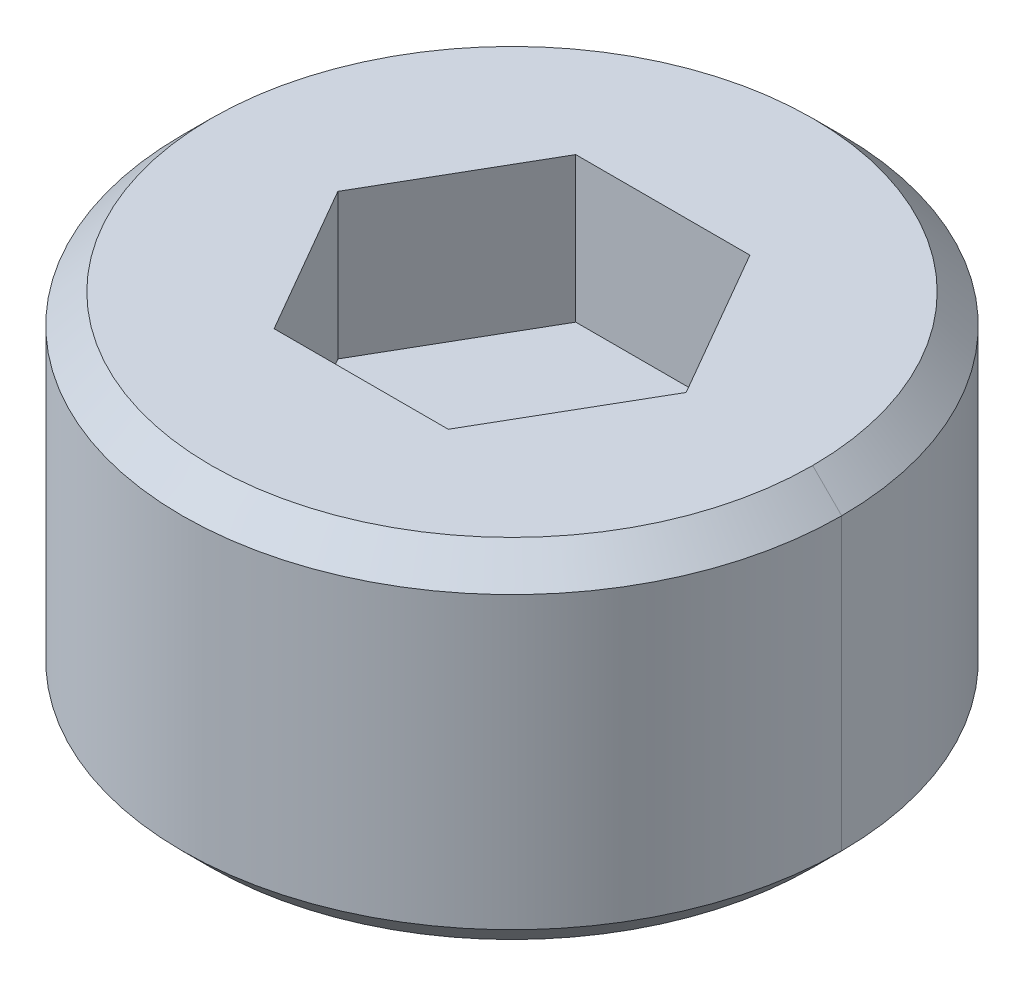
ISO-10303-21;
HEADER;
FILE_DESCRIPTION(('STEP AP214'),'2;1');
FILE_NAME('part.step','',(''),(''),'','','');
FILE_SCHEMA(('AUTOMOTIVE_DESIGN { 1 0 10303 214 1 1 1 1 }'));
ENDSEC;
DATA;
#1=APPLICATION_CONTEXT('core data for automotive mechanical design processes');
#2=APPLICATION_PROTOCOL_DEFINITION('international standard','automotive_design',2000,#1);
#3=PRODUCT_CONTEXT('',#1,'mechanical');
#4=PRODUCT('Part','Part','',(#3));
#5=PRODUCT_RELATED_PRODUCT_CATEGORY('part','',(#4));
#6=PRODUCT_DEFINITION_FORMATION('','',#4);
#7=PRODUCT_DEFINITION_CONTEXT('part definition',#1,'design');
#8=PRODUCT_DEFINITION('design','',#6,#7);
#9=PRODUCT_DEFINITION_SHAPE('','',#8);
#10=(LENGTH_UNIT() NAMED_UNIT(*) SI_UNIT(.MILLI.,.METRE.));
#11=(NAMED_UNIT(*) PLANE_ANGLE_UNIT() SI_UNIT($,.RADIAN.));
#12=(NAMED_UNIT(*) SI_UNIT($,.STERADIAN.) SOLID_ANGLE_UNIT());
#13=UNCERTAINTY_MEASURE_WITH_UNIT(LENGTH_MEASURE(1.E-05),#10,'distance_accuracy_value','');
#14=(GEOMETRIC_REPRESENTATION_CONTEXT(3) GLOBAL_UNCERTAINTY_ASSIGNED_CONTEXT((#13)) GLOBAL_UNIT_ASSIGNED_CONTEXT((#10,
#11,#12)) REPRESENTATION_CONTEXT('',''));
#15=CARTESIAN_POINT('',(0.,0.,0.));
#16=DIRECTION('',(0.,0.,1.));
#17=DIRECTION('',(1.,0.,0.));
#18=AXIS2_PLACEMENT_3D('',#15,#16,#17);
#19=CARTESIAN_POINT('',(0.,1.75,0.));
#20=DIRECTION('',(0.,1.,0.));
#21=DIRECTION('',(1.,0.,0.));
#22=AXIS2_PLACEMENT_3D('',#19,#20,#21);
#23=PLANE('',#22);
#24=DIRECTION('',(1.,0.,0.));
#25=VECTOR('',#24,1.);
#26=CARTESIAN_POINT('',(-0.7499999999999,1.75,1.299038105677));
#27=LINE('',#26,#25);
#28=CARTESIAN_POINT('',(-0.7499999999999,1.75,1.299038105677));
#29=VERTEX_POINT('',#28);
#30=CARTESIAN_POINT('',(0.75,1.75,1.299038105677));
#31=VERTEX_POINT('',#30);
#32=EDGE_CURVE('E11',#29,#31,#27,.T.);
#33=ORIENTED_EDGE('',*,*,#32,.T.);
#34=DIRECTION('',(-0.499999999999974,0.,0.866025403784454));
#35=VECTOR('',#34,1.);
#36=CARTESIAN_POINT('',(1.5,1.75,0.));
#37=LINE('',#36,#35);
#38=CARTESIAN_POINT('',(1.5,1.75,0.));
#39=VERTEX_POINT('',#38);
#40=EDGE_CURVE('E266',#39,#31,#37,.T.);
#41=ORIENTED_EDGE('',*,*,#40,.F.);
#42=DIRECTION('',(0.500000000000017,0.,0.866025403784429));
#43=VECTOR('',#42,1.);
#44=CARTESIAN_POINT('',(0.7499999999999,1.75,-1.299038105677));
#45=LINE('',#44,#43);
#46=CARTESIAN_POINT('',(0.7499999999999,1.75,-1.299038105677));
#47=VERTEX_POINT('',#46);
#48=EDGE_CURVE('E245',#47,#39,#45,.T.);
#49=ORIENTED_EDGE('',*,*,#48,.F.);
#50=DIRECTION('',(-1.,0.,0.));
#51=VECTOR('',#50,1.);
#52=CARTESIAN_POINT('',(0.7499999999999,1.75,-1.299038105677));
#53=LINE('',#52,#51);
#54=CARTESIAN_POINT('',(-0.75,1.75,-1.299038105677));
#55=VERTEX_POINT('',#54);
#56=EDGE_CURVE('E202',#47,#55,#53,.T.);
#57=ORIENTED_EDGE('',*,*,#56,.T.);
#58=DIRECTION('',(0.499999999999974,0.,-0.866025403784454));
#59=VECTOR('',#58,1.);
#60=CARTESIAN_POINT('',(-1.5,1.75,0.));
#61=LINE('',#60,#59);
#62=CARTESIAN_POINT('',(-1.5,1.75,0.));
#63=VERTEX_POINT('',#62);
#64=EDGE_CURVE('E164',#63,#55,#61,.T.);
#65=ORIENTED_EDGE('',*,*,#64,.F.);
#66=DIRECTION('',(-0.500000000000017,0.,-0.866025403784429));
#67=VECTOR('',#66,1.);
#68=CARTESIAN_POINT('',(-0.7499999999999,1.75,1.299038105677));
#69=LINE('',#68,#67);
#70=EDGE_CURVE('E159',#29,#63,#69,.T.);
#71=ORIENTED_EDGE('',*,*,#70,.F.);
#72=EDGE_LOOP('',(#33,#41,#49,#57,#65,#71));
#73=FACE_BOUND('',#72,.T.);
#74=ADVANCED_FACE('F17',(#73),#23,.T.);
#75=CARTESIAN_POINT('',(-0.75,3.,1.299038105677));
#76=DIRECTION('',(0.,0.,1.));
#77=DIRECTION('',(1.,0.,0.));
#78=AXIS2_PLACEMENT_3D('',#75,#76,#77);
#79=PLANE('',#78);
#80=DIRECTION('',(0.,-1.,0.));
#81=VECTOR('',#80,1.);
#82=CARTESIAN_POINT('',(0.75,3.,1.299038105677));
#83=LINE('',#82,#81);
#84=CARTESIAN_POINT('',(0.75,3.,1.299038105677));
#85=VERTEX_POINT('',#84);
#86=EDGE_CURVE('E28',#85,#31,#83,.T.);
#87=ORIENTED_EDGE('',*,*,#86,.T.);
#88=ORIENTED_EDGE('',*,*,#32,.F.);
#89=DIRECTION('',(0.,-1.,0.));
#90=VECTOR('',#89,1.);
#91=CARTESIAN_POINT('',(-0.7499999999998,3.,1.299038105677));
#92=LINE('',#91,#90);
#93=CARTESIAN_POINT('',(-0.7499999999998,3.,1.299038105677));
#94=VERTEX_POINT('',#93);
#95=EDGE_CURVE('E195',#94,#29,#92,.T.);
#96=ORIENTED_EDGE('',*,*,#95,.F.);
#97=DIRECTION('',(1.,0.,0.));
#98=VECTOR('',#97,1.);
#99=CARTESIAN_POINT('',(-0.7499999999998,3.,1.299038105677));
#100=LINE('',#99,#98);
#101=EDGE_CURVE('E173',#94,#85,#100,.T.);
#102=ORIENTED_EDGE('',*,*,#101,.T.);
#103=EDGE_LOOP('',(#87,#88,#96,#102));
#104=FACE_BOUND('',#103,.T.);
#105=ADVANCED_FACE('F322',(#104),#79,.F.);
#106=CARTESIAN_POINT('',(0.75,3.,1.299038105677));
#107=DIRECTION('',(0.866025403784429,0.,0.500000000000017));
#108=DIRECTION('',(0.,-1.,0.));
#109=AXIS2_PLACEMENT_3D('',#106,#107,#108);
#110=PLANE('',#109);
#111=DIRECTION('',(0.,-1.,0.));
#112=VECTOR('',#111,1.);
#113=CARTESIAN_POINT('',(1.5,3.,1.416526265779E-13));
#114=LINE('',#113,#112);
#115=CARTESIAN_POINT('',(1.5,3.,1.416644579422E-13));
#116=VERTEX_POINT('',#115);
#117=EDGE_CURVE('E248',#116,#39,#114,.T.);
#118=ORIENTED_EDGE('',*,*,#117,.T.);
#119=ORIENTED_EDGE('',*,*,#40,.T.);
#120=ORIENTED_EDGE('',*,*,#86,.F.);
#121=DIRECTION('',(0.499999999999974,0.,-0.866025403784454));
#122=VECTOR('',#121,1.);
#123=CARTESIAN_POINT('',(0.75,3.,1.299038105677));
#124=LINE('',#123,#122);
#125=EDGE_CURVE('E208',#85,#116,#124,.T.);
#126=ORIENTED_EDGE('',*,*,#125,.T.);
#127=EDGE_LOOP('',(#118,#119,#120,#126));
#128=FACE_BOUND('',#127,.T.);
#129=ADVANCED_FACE('F311',(#128),#110,.F.);
#130=CARTESIAN_POINT('',(1.5,3.,0.));
#131=DIRECTION('',(0.866025403784429,0.,-0.500000000000017));
#132=DIRECTION('',(0.,-1.,0.));
#133=AXIS2_PLACEMENT_3D('',#130,#131,#132);
#134=PLANE('',#133);
#135=DIRECTION('',(0.,-1.,0.));
#136=VECTOR('',#135,1.);
#137=CARTESIAN_POINT('',(0.7499999999998,3.,-1.299038105677));
#138=LINE('',#137,#136);
#139=CARTESIAN_POINT('',(0.7499999999998,3.,-1.299038105677));
#140=VERTEX_POINT('',#139);
#141=EDGE_CURVE('E205',#140,#47,#138,.T.);
#142=ORIENTED_EDGE('',*,*,#141,.T.);
#143=ORIENTED_EDGE('',*,*,#48,.T.);
#144=ORIENTED_EDGE('',*,*,#117,.F.);
#145=DIRECTION('',(-0.500000000000017,0.,-0.866025403784429));
#146=VECTOR('',#145,1.);
#147=CARTESIAN_POINT('',(1.5,3.,1.416526265779E-13));
#148=LINE('',#147,#146);
#149=EDGE_CURVE('E187',#116,#140,#148,.T.);
#150=ORIENTED_EDGE('',*,*,#149,.T.);
#151=EDGE_LOOP('',(#142,#143,#144,#150));
#152=FACE_BOUND('',#151,.T.);
#153=ADVANCED_FACE('F316',(#152),#134,.F.);
#154=CARTESIAN_POINT('',(0.75,3.,-1.299038105677));
#155=DIRECTION('',(0.,0.,-1.));
#156=DIRECTION('',(0.,-1.,0.));
#157=AXIS2_PLACEMENT_3D('',#154,#155,#156);
#158=PLANE('',#157);
#159=DIRECTION('',(0.,-1.,0.));
#160=VECTOR('',#159,1.);
#161=CARTESIAN_POINT('',(-0.75,3.,-1.299038105677));
#162=LINE('',#161,#160);
#163=CARTESIAN_POINT('',(-0.75,3.,-1.299038105677));
#164=VERTEX_POINT('',#163);
#165=EDGE_CURVE('E179',#164,#55,#162,.T.);
#166=ORIENTED_EDGE('',*,*,#165,.T.);
#167=ORIENTED_EDGE('',*,*,#56,.F.);
#168=ORIENTED_EDGE('',*,*,#141,.F.);
#169=DIRECTION('',(-1.,0.,0.));
#170=VECTOR('',#169,1.);
#171=CARTESIAN_POINT('',(0.7499999999998,3.,-1.299038105677));
#172=LINE('',#171,#170);
#173=EDGE_CURVE('E182',#140,#164,#172,.T.);
#174=ORIENTED_EDGE('',*,*,#173,.T.);
#175=EDGE_LOOP('',(#166,#167,#168,#174));
#176=FACE_BOUND('',#175,.T.);
#177=ADVANCED_FACE('F319',(#176),#158,.F.);
#178=CARTESIAN_POINT('',(-0.75,3.,-1.299038105677));
#179=DIRECTION('',(-0.866025403784429,0.,-0.500000000000017));
#180=DIRECTION('',(-0.500000000000017,0.,0.866025403784429));
#181=AXIS2_PLACEMENT_3D('',#178,#179,#180);
#182=PLANE('',#181);
#183=DIRECTION('',(0.,-1.,0.));
#184=VECTOR('',#183,1.);
#185=CARTESIAN_POINT('',(-1.5,3.,-1.416526265779E-13));
#186=LINE('',#185,#184);
#187=CARTESIAN_POINT('',(-1.5,3.,-1.416526265779E-13));
#188=VERTEX_POINT('',#187);
#189=EDGE_CURVE('E153',#188,#63,#186,.T.);
#190=ORIENTED_EDGE('',*,*,#189,.T.);
#191=ORIENTED_EDGE('',*,*,#64,.T.);
#192=ORIENTED_EDGE('',*,*,#165,.F.);
#193=DIRECTION('',(-0.499999999999974,0.,0.866025403784454));
#194=VECTOR('',#193,1.);
#195=CARTESIAN_POINT('',(-0.75,3.,-1.299038105677));
#196=LINE('',#195,#194);
#197=EDGE_CURVE('E170',#164,#188,#196,.T.);
#198=ORIENTED_EDGE('',*,*,#197,.T.);
#199=EDGE_LOOP('',(#190,#191,#192,#198));
#200=FACE_BOUND('',#199,.T.);
#201=ADVANCED_FACE('F177',(#200),#182,.F.);
#202=CARTESIAN_POINT('',(-1.5,3.,0.));
#203=DIRECTION('',(-0.866025403784429,0.,0.500000000000017));
#204=DIRECTION('',(0.,1.,0.));
#205=AXIS2_PLACEMENT_3D('',#202,#203,#204);
#206=PLANE('',#205);
#207=ORIENTED_EDGE('',*,*,#95,.T.);
#208=ORIENTED_EDGE('',*,*,#70,.T.);
#209=ORIENTED_EDGE('',*,*,#189,.F.);
#210=DIRECTION('',(0.500000000000017,0.,0.866025403784429));
#211=VECTOR('',#210,1.);
#212=CARTESIAN_POINT('',(-1.5,3.,-1.416526265779E-13));
#213=LINE('',#212,#211);
#214=EDGE_CURVE('E157',#188,#94,#213,.T.);
#215=ORIENTED_EDGE('',*,*,#214,.T.);
#216=EDGE_LOOP('',(#207,#208,#209,#215));
#217=FACE_BOUND('',#216,.T.);
#218=ADVANCED_FACE('F156',(#217),#206,.F.);
#219=CARTESIAN_POINT('',(0.,0.,0.));
#220=DIRECTION('',(0.,1.,0.));
#221=DIRECTION('',(1.,0.,0.));
#222=AXIS2_PLACEMENT_3D('',#219,#220,#221);
#223=CYLINDRICAL_SURFACE('',#222,2.84);
#224=DIRECTION('',(0.,1.,0.));
#225=VECTOR('',#224,1.);
#226=CARTESIAN_POINT('',(2.84,0.25,-5.862598078934E-11));
#227=LINE('',#226,#225);
#228=CARTESIAN_POINT('',(2.84,0.25,-5.862598078934E-11));
#229=VERTEX_POINT('',#228);
#230=CARTESIAN_POINT('',(2.84,2.75,0.));
#231=VERTEX_POINT('',#230);
#232=EDGE_CURVE('E201',#229,#231,#227,.T.);
#233=ORIENTED_EDGE('',*,*,#232,.F.);
#234=CARTESIAN_POINT('',(0.,0.25,0.));
#235=DIRECTION('',(0.,1.,0.));
#236=DIRECTION('',(1.,0.,0.));
#237=AXIS2_PLACEMENT_3D('',#234,#235,#236);
#238=CIRCLE('',#237,2.84);
#239=CARTESIAN_POINT('',(0.,0.25,-2.84));
#240=VERTEX_POINT('',#239);
#241=EDGE_CURVE('E219',#229,#240,#238,.T.);
#242=ORIENTED_EDGE('',*,*,#241,.T.);
#243=CARTESIAN_POINT('',(0.,0.25,0.));
#244=DIRECTION('',(0.,1.,0.));
#245=DIRECTION('',(0.,0.,-1.));
#246=AXIS2_PLACEMENT_3D('',#243,#244,#245);
#247=CIRCLE('',#246,2.84);
#248=CARTESIAN_POINT('',(-2.84,0.25,1.882546637798E-10));
#249=VERTEX_POINT('',#248);
#250=EDGE_CURVE('E215',#240,#249,#247,.T.);
#251=ORIENTED_EDGE('',*,*,#250,.T.);
#252=DIRECTION('',(0.,1.,0.));
#253=VECTOR('',#252,1.);
#254=CARTESIAN_POINT('',(-2.84,0.25,1.754364087863E-10));
#255=LINE('',#254,#253);
#256=CARTESIAN_POINT('',(-2.84,2.75,1.882546637798E-10));
#257=VERTEX_POINT('',#256);
#258=EDGE_CURVE('E270',#249,#257,#255,.T.);
#259=ORIENTED_EDGE('',*,*,#258,.T.);
#260=CARTESIAN_POINT('',(0.,2.75,0.));
#261=DIRECTION('',(0.,-1.,0.));
#262=DIRECTION('',(-1.,0.,6.628685344359E-11));
#263=AXIS2_PLACEMENT_3D('',#260,#261,#262);
#264=CIRCLE('',#263,2.84);
#265=CARTESIAN_POINT('',(0.,2.75,-2.84));
#266=VERTEX_POINT('',#265);
#267=EDGE_CURVE('E193',#257,#266,#264,.T.);
#268=ORIENTED_EDGE('',*,*,#267,.T.);
#269=CARTESIAN_POINT('',(0.,2.75,0.));
#270=DIRECTION('',(0.,-1.,0.));
#271=DIRECTION('',(0.,0.,-1.));
#272=AXIS2_PLACEMENT_3D('',#269,#270,#271);
#273=CIRCLE('',#272,2.84);
#274=EDGE_CURVE('E175',#266,#231,#273,.T.);
#275=ORIENTED_EDGE('',*,*,#274,.T.);
#276=EDGE_LOOP('',(#233,#242,#251,#259,#268,#275));
#277=FACE_BOUND('',#276,.T.);
#278=ADVANCED_FACE('F328',(#277),#223,.T.);
#279=CARTESIAN_POINT('',(0.,2.875,0.));
#280=DIRECTION('',(0.,-1.,0.));
#281=DIRECTION('',(0.,0.,-1.));
#282=AXIS2_PLACEMENT_3D('',#279,#280,#281);
#283=CONICAL_SURFACE('',#282,2.715,0.7853981633973);
#284=DIRECTION('',(0.707106781186548,-0.707106781186548,3.58119081961324E-11));
#285=VECTOR('',#284,1.);
#286=CARTESIAN_POINT('',(2.59,3.,-7.128820686222E-11));
#287=LINE('',#286,#285);
#288=CARTESIAN_POINT('',(2.59,3.,0.));
#289=VERTEX_POINT('',#288);
#290=EDGE_CURVE('E253',#289,#231,#287,.T.);
#291=ORIENTED_EDGE('',*,*,#290,.T.);
#292=ORIENTED_EDGE('',*,*,#274,.F.);
#293=ORIENTED_EDGE('',*,*,#267,.F.);
#294=DIRECTION('',(-0.707106781186548,-0.707106781186548,2.16565766845715E-10));
#295=VECTOR('',#294,1.);
#296=CARTESIAN_POINT('',(-2.59,3.,9.886902153139E-11));
#297=LINE('',#296,#295);
#298=CARTESIAN_POINT('',(-2.59,3.,0.));
#299=VERTEX_POINT('',#298);
#300=EDGE_CURVE('E238',#299,#257,#297,.T.);
#301=ORIENTED_EDGE('',*,*,#300,.F.);
#302=CARTESIAN_POINT('',(0.,3.,0.));
#303=DIRECTION('',(0.,-1.,0.));
#304=DIRECTION('',(-1.,0.,0.));
#305=AXIS2_PLACEMENT_3D('',#302,#303,#304);
#306=CIRCLE('',#305,2.59);
#307=CARTESIAN_POINT('',(0.,3.,-2.59));
#308=VERTEX_POINT('',#307);
#309=EDGE_CURVE('E96',#299,#308,#306,.T.);
#310=ORIENTED_EDGE('',*,*,#309,.T.);
#311=CARTESIAN_POINT('',(0.,3.,0.));
#312=DIRECTION('',(0.,-1.,0.));
#313=DIRECTION('',(0.,0.,-1.));
#314=AXIS2_PLACEMENT_3D('',#311,#312,#313);
#315=CIRCLE('',#314,2.59);
#316=EDGE_CURVE('E107',#308,#289,#315,.T.);
#317=ORIENTED_EDGE('',*,*,#316,.T.);
#318=EDGE_LOOP('',(#291,#292,#293,#301,#310,#317));
#319=FACE_BOUND('',#318,.T.);
#320=ADVANCED_FACE('F329',(#319),#283,.T.);
#321=CARTESIAN_POINT('',(0.,3.,0.));
#322=DIRECTION('',(0.,1.,0.));
#323=DIRECTION('',(1.,0.,0.));
#324=AXIS2_PLACEMENT_3D('',#321,#322,#323);
#325=PLANE('',#324);
#326=ORIENTED_EDGE('',*,*,#197,.F.);
#327=ORIENTED_EDGE('',*,*,#173,.F.);
#328=ORIENTED_EDGE('',*,*,#149,.F.);
#329=ORIENTED_EDGE('',*,*,#125,.F.);
#330=ORIENTED_EDGE('',*,*,#101,.F.);
#331=ORIENTED_EDGE('',*,*,#214,.F.);
#332=EDGE_LOOP('',(#326,#327,#328,#329,#330,#331));
#333=FACE_BOUND('',#332,.T.);
#334=CARTESIAN_POINT('',(0.,3.,0.));
#335=DIRECTION('',(0.,-1.,0.));
#336=DIRECTION('',(0.,0.,1.));
#337=AXIS2_PLACEMENT_3D('',#334,#335,#336);
#338=CIRCLE('',#337,2.59);
#339=CARTESIAN_POINT('',(0.,3.,2.59));
#340=VERTEX_POINT('',#339);
#341=EDGE_CURVE('E263',#340,#299,#338,.T.);
#342=ORIENTED_EDGE('',*,*,#341,.F.);
#343=CARTESIAN_POINT('',(0.,3.,0.));
#344=DIRECTION('',(0.,-1.,0.));
#345=DIRECTION('',(1.,0.,0.));
#346=AXIS2_PLACEMENT_3D('',#343,#344,#345);
#347=CIRCLE('',#346,2.59);
#348=EDGE_CURVE('E256',#289,#340,#347,.T.);
#349=ORIENTED_EDGE('',*,*,#348,.F.);
#350=ORIENTED_EDGE('',*,*,#316,.F.);
#351=ORIENTED_EDGE('',*,*,#309,.F.);
#352=EDGE_LOOP('',(#342,#349,#350,#351));
#353=FACE_BOUND('',#352,.T.);
#354=ADVANCED_FACE('F168',(#333,#353),#325,.T.);
#355=CARTESIAN_POINT('',(0.,2.875,0.));
#356=DIRECTION('',(0.,-1.,0.));
#357=DIRECTION('',(0.,0.,-1.));
#358=AXIS2_PLACEMENT_3D('',#355,#356,#357);
#359=CONICAL_SURFACE('',#358,2.715,0.7853981633973);
#360=ORIENTED_EDGE('',*,*,#300,.T.);
#361=CARTESIAN_POINT('',(0.,2.75,0.));
#362=DIRECTION('',(0.,-1.,0.));
#363=DIRECTION('',(0.,0.,1.));
#364=AXIS2_PLACEMENT_3D('',#361,#362,#363);
#365=CIRCLE('',#364,2.84);
#366=CARTESIAN_POINT('',(0.,2.75,2.84));
#367=VERTEX_POINT('',#366);
#368=EDGE_CURVE('E21',#367,#257,#365,.T.);
#369=ORIENTED_EDGE('',*,*,#368,.F.);
#370=CARTESIAN_POINT('',(0.,2.75,0.));
#371=DIRECTION('',(0.,-1.,0.));
#372=DIRECTION('',(1.,0.,0.));
#373=AXIS2_PLACEMENT_3D('',#370,#371,#372);
#374=CIRCLE('',#373,2.84);
#375=EDGE_CURVE('E197',#231,#367,#374,.T.);
#376=ORIENTED_EDGE('',*,*,#375,.F.);
#377=ORIENTED_EDGE('',*,*,#290,.F.);
#378=ORIENTED_EDGE('',*,*,#348,.T.);
#379=ORIENTED_EDGE('',*,*,#341,.T.);
#380=EDGE_LOOP('',(#360,#369,#376,#377,#378,#379));
#381=FACE_BOUND('',#380,.T.);
#382=ADVANCED_FACE('F331',(#381),#359,.T.);
#383=CARTESIAN_POINT('',(0.,0.,0.));
#384=DIRECTION('',(0.,1.,0.));
#385=DIRECTION('',(1.,0.,0.));
#386=AXIS2_PLACEMENT_3D('',#383,#384,#385);
#387=CYLINDRICAL_SURFACE('',#386,2.84);
#388=ORIENTED_EDGE('',*,*,#258,.F.);
#389=CARTESIAN_POINT('',(0.,0.25,0.));
#390=DIRECTION('',(0.,1.,0.));
#391=DIRECTION('',(-1.,0.,6.628685344359E-11));
#392=AXIS2_PLACEMENT_3D('',#389,#390,#391);
#393=CIRCLE('',#392,2.84);
#394=CARTESIAN_POINT('',(0.,0.25,2.84));
#395=VERTEX_POINT('',#394);
#396=EDGE_CURVE('E267',#249,#395,#393,.T.);
#397=ORIENTED_EDGE('',*,*,#396,.T.);
#398=CARTESIAN_POINT('',(0.,0.25,0.));
#399=DIRECTION('',(0.,1.,0.));
#400=DIRECTION('',(0.,0.,1.));
#401=AXIS2_PLACEMENT_3D('',#398,#399,#400);
#402=CIRCLE('',#401,2.84);
#403=EDGE_CURVE('E271',#395,#229,#402,.T.);
#404=ORIENTED_EDGE('',*,*,#403,.T.);
#405=ORIENTED_EDGE('',*,*,#232,.T.);
#406=ORIENTED_EDGE('',*,*,#375,.T.);
#407=ORIENTED_EDGE('',*,*,#368,.T.);
#408=EDGE_LOOP('',(#388,#397,#404,#405,#406,#407));
#409=FACE_BOUND('',#408,.T.);
#410=ADVANCED_FACE('F334',(#409),#387,.T.);
#411=CARTESIAN_POINT('',(0.,0.125,0.));
#412=DIRECTION('',(0.,1.,0.));
#413=DIRECTION('',(0.,0.,-1.));
#414=AXIS2_PLACEMENT_3D('',#411,#412,#413);
#415=CONICAL_SURFACE('',#414,2.715,0.7853981633973);
#416=DIRECTION('',(0.707106781186548,0.707106781186548,3.58112672555624E-11));
#417=VECTOR('',#416,1.);
#418=CARTESIAN_POINT('',(2.59,0.,-7.128717574898E-11));
#419=LINE('',#418,#417);
#420=CARTESIAN_POINT('',(2.59,0.,0.));
#421=VERTEX_POINT('',#420);
#422=EDGE_CURVE('E222',#421,#229,#419,.T.);
#423=ORIENTED_EDGE('',*,*,#422,.T.);
#424=ORIENTED_EDGE('',*,*,#403,.F.);
#425=ORIENTED_EDGE('',*,*,#396,.F.);
#426=DIRECTION('',(-0.707106781186548,0.707106781186548,2.16566022590215E-10));
#427=VECTOR('',#426,1.);
#428=CARTESIAN_POINT('',(-2.59,0.,9.886875721219E-11));
#429=LINE('',#428,#427);
#430=CARTESIAN_POINT('',(-2.59,0.,0.));
#431=VERTEX_POINT('',#430);
#432=EDGE_CURVE('E220',#431,#249,#429,.T.);
#433=ORIENTED_EDGE('',*,*,#432,.F.);
#434=CARTESIAN_POINT('',(0.,0.,0.));
#435=DIRECTION('',(0.,1.,0.));
#436=DIRECTION('',(-1.,0.,0.));
#437=AXIS2_PLACEMENT_3D('',#434,#435,#436);
#438=CIRCLE('',#437,2.59);
#439=CARTESIAN_POINT('',(0.,0.,2.59));
#440=VERTEX_POINT('',#439);
#441=EDGE_CURVE('E214',#431,#440,#438,.T.);
#442=ORIENTED_EDGE('',*,*,#441,.T.);
#443=CARTESIAN_POINT('',(0.,0.,0.));
#444=DIRECTION('',(0.,1.,0.));
#445=DIRECTION('',(0.,0.,1.));
#446=AXIS2_PLACEMENT_3D('',#443,#444,#445);
#447=CIRCLE('',#446,2.59);
#448=EDGE_CURVE('E240',#440,#421,#447,.T.);
#449=ORIENTED_EDGE('',*,*,#448,.T.);
#450=EDGE_LOOP('',(#423,#424,#425,#433,#442,#449));
#451=FACE_BOUND('',#450,.T.);
#452=ADVANCED_FACE('F339',(#451),#415,.T.);
#453=CARTESIAN_POINT('',(0.,0.125,0.));
#454=DIRECTION('',(0.,1.,0.));
#455=DIRECTION('',(0.,0.,-1.));
#456=AXIS2_PLACEMENT_3D('',#453,#454,#455);
#457=CONICAL_SURFACE('',#456,2.715,0.7853981633973);
#458=ORIENTED_EDGE('',*,*,#432,.T.);
#459=ORIENTED_EDGE('',*,*,#250,.F.);
#460=ORIENTED_EDGE('',*,*,#241,.F.);
#461=ORIENTED_EDGE('',*,*,#422,.F.);
#462=CARTESIAN_POINT('',(0.,0.,0.));
#463=DIRECTION('',(0.,1.,0.));
#464=DIRECTION('',(1.,0.,0.));
#465=AXIS2_PLACEMENT_3D('',#462,#463,#464);
#466=CIRCLE('',#465,2.59);
#467=CARTESIAN_POINT('',(0.,0.,-2.59));
#468=VERTEX_POINT('',#467);
#469=EDGE_CURVE('E213',#421,#468,#466,.T.);
#470=ORIENTED_EDGE('',*,*,#469,.T.);
#471=CARTESIAN_POINT('',(0.,0.,0.));
#472=DIRECTION('',(0.,1.,0.));
#473=DIRECTION('',(0.,0.,-1.));
#474=AXIS2_PLACEMENT_3D('',#471,#472,#473);
#475=CIRCLE('',#474,2.59);
#476=EDGE_CURVE('E209',#468,#431,#475,.T.);
#477=ORIENTED_EDGE('',*,*,#476,.T.);
#478=EDGE_LOOP('',(#458,#459,#460,#461,#470,#477));
#479=FACE_BOUND('',#478,.T.);
#480=ADVANCED_FACE('F19',(#479),#457,.T.);
#481=CARTESIAN_POINT('',(0.,0.,0.));
#482=DIRECTION('',(0.,1.,0.));
#483=DIRECTION('',(1.,0.,0.));
#484=AXIS2_PLACEMENT_3D('',#481,#482,#483);
#485=PLANE('',#484);
#486=ORIENTED_EDGE('',*,*,#448,.F.);
#487=ORIENTED_EDGE('',*,*,#441,.F.);
#488=ORIENTED_EDGE('',*,*,#476,.F.);
#489=ORIENTED_EDGE('',*,*,#469,.F.);
#490=EDGE_LOOP('',(#486,#487,#488,#489));
#491=FACE_BOUND('',#490,.T.);
#492=ADVANCED_FACE('F338',(#491),#485,.F.);
#493=CLOSED_SHELL('',(#74,#105,#129,#153,#177,#201,#218,#278,#320,#354,#382,#410,#452,#480,#492));
#494=MANIFOLD_SOLID_BREP('B1',#493);
#495=ADVANCED_BREP_SHAPE_REPRESENTATION('',(#18,#494),#14);
#496=SHAPE_DEFINITION_REPRESENTATION(#9,#495);
ENDSEC;
END-ISO-10303-21;
